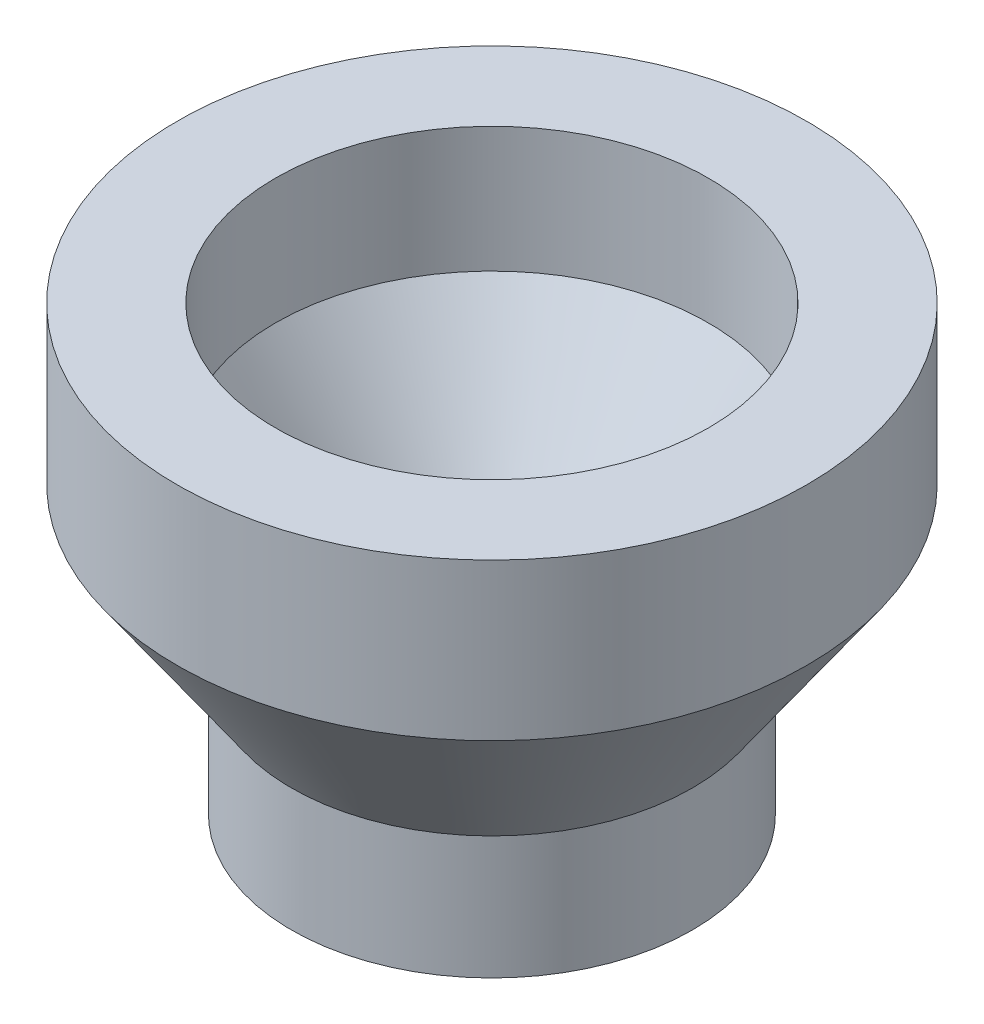
ISO-10303-21;
HEADER;
FILE_DESCRIPTION(('STEP AP214'),'2;1');
FILE_NAME('part.step','',(''),(''),'','','');
FILE_SCHEMA(('AUTOMOTIVE_DESIGN { 1 0 10303 214 1 1 1 1 }'));
ENDSEC;
DATA;
#1=APPLICATION_CONTEXT('core data for automotive mechanical design processes');
#2=APPLICATION_PROTOCOL_DEFINITION('international standard','automotive_design',2000,#1);
#3=PRODUCT_CONTEXT('',#1,'mechanical');
#4=PRODUCT('Part','Part','',(#3));
#5=PRODUCT_RELATED_PRODUCT_CATEGORY('part','',(#4));
#6=PRODUCT_DEFINITION_FORMATION('','',#4);
#7=PRODUCT_DEFINITION_CONTEXT('part definition',#1,'design');
#8=PRODUCT_DEFINITION('design','',#6,#7);
#9=PRODUCT_DEFINITION_SHAPE('','',#8);
#10=(LENGTH_UNIT() NAMED_UNIT(*) SI_UNIT(.MILLI.,.METRE.));
#11=(NAMED_UNIT(*) PLANE_ANGLE_UNIT() SI_UNIT($,.RADIAN.));
#12=(NAMED_UNIT(*) SI_UNIT($,.STERADIAN.) SOLID_ANGLE_UNIT());
#13=UNCERTAINTY_MEASURE_WITH_UNIT(LENGTH_MEASURE(1.E-05),#10,'distance_accuracy_value','');
#14=(GEOMETRIC_REPRESENTATION_CONTEXT(3) GLOBAL_UNCERTAINTY_ASSIGNED_CONTEXT((#13)) GLOBAL_UNIT_ASSIGNED_CONTEXT((#10,
#11,#12)) REPRESENTATION_CONTEXT('',''));
#15=CARTESIAN_POINT('',(0.,0.,0.));
#16=DIRECTION('',(0.,0.,1.));
#17=DIRECTION('',(1.,0.,0.));
#18=AXIS2_PLACEMENT_3D('',#15,#16,#17);
#19=CARTESIAN_POINT('',(0.,9.79011851256967,0.));
#20=DIRECTION('',(0.,-1.,0.));
#21=DIRECTION('',(1.,0.,0.));
#22=AXIS2_PLACEMENT_3D('',#19,#20,#21);
#23=CYLINDRICAL_SURFACE('',#22,2.575);
#24=CARTESIAN_POINT('',(0.,38.6347900936987,0.));
#25=DIRECTION('',(0.,-1.,0.));
#26=DIRECTION('',(1.,0.,0.));
#27=AXIS2_PLACEMENT_3D('',#24,#25,#26);
#28=CIRCLE('',#27,2.575);
#29=CARTESIAN_POINT('',(2.575,38.6347900936987,0.));
#30=VERTEX_POINT('',#29);
#31=EDGE_CURVE('E59',#30,#30,#28,.T.);
#32=ORIENTED_EDGE('',*,*,#31,.F.);
#33=EDGE_LOOP('',(#32));
#34=FACE_BOUND('',#33,.T.);
#35=CARTESIAN_POINT('',(0.,34.7901185125697,0.));
#36=DIRECTION('',(0.,-1.,0.));
#37=DIRECTION('',(1.,0.,0.));
#38=AXIS2_PLACEMENT_3D('',#35,#36,#37);
#39=CIRCLE('',#38,2.575);
#40=CARTESIAN_POINT('',(2.575,34.7901185125697,0.));
#41=VERTEX_POINT('',#40);
#42=EDGE_CURVE('E10',#41,#41,#39,.T.);
#43=ORIENTED_EDGE('',*,*,#42,.T.);
#44=EDGE_LOOP('',(#43));
#45=FACE_BOUND('',#44,.T.);
#46=ADVANCED_FACE('F31',(#34,#45),#23,.F.);
#47=CARTESIAN_POINT('',(-2.575,34.7901185125697,0.));
#48=DIRECTION('',(0.,1.,0.));
#49=DIRECTION('',(-1.,0.,0.));
#50=AXIS2_PLACEMENT_3D('',#47,#48,#49);
#51=PLANE('',#50);
#52=ORIENTED_EDGE('',*,*,#42,.F.);
#53=EDGE_LOOP('',(#52));
#54=FACE_BOUND('',#53,.T.);
#55=CARTESIAN_POINT('',(0.,34.7901185125697,0.));
#56=DIRECTION('',(0.,-1.,0.));
#57=DIRECTION('',(1.,0.,0.));
#58=AXIS2_PLACEMENT_3D('',#55,#56,#57);
#59=CIRCLE('',#58,4.075);
#60=CARTESIAN_POINT('',(4.075,34.7901185125697,0.));
#61=VERTEX_POINT('',#60);
#62=EDGE_CURVE('E37',#61,#61,#59,.T.);
#63=ORIENTED_EDGE('',*,*,#62,.T.);
#64=EDGE_LOOP('',(#63));
#65=FACE_BOUND('',#64,.T.);
#66=ADVANCED_FACE('F66',(#54,#65),#51,.F.);
#67=CARTESIAN_POINT('',(0.,9.79011851256967,0.));
#68=DIRECTION('',(0.,-1.,0.));
#69=DIRECTION('',(1.,0.,0.));
#70=AXIS2_PLACEMENT_3D('',#67,#68,#69);
#71=CYLINDRICAL_SURFACE('',#70,4.075);
#72=ORIENTED_EDGE('',*,*,#62,.F.);
#73=EDGE_LOOP('',(#72));
#74=FACE_BOUND('',#73,.T.);
#75=CARTESIAN_POINT('',(0.,37.2901185125697,0.));
#76=DIRECTION('',(0.,-1.,0.));
#77=DIRECTION('',(1.,0.,0.));
#78=AXIS2_PLACEMENT_3D('',#75,#76,#77);
#79=CIRCLE('',#78,4.075);
#80=CARTESIAN_POINT('',(4.075,37.2901185125697,0.));
#81=VERTEX_POINT('',#80);
#82=EDGE_CURVE('E41',#81,#81,#79,.T.);
#83=ORIENTED_EDGE('',*,*,#82,.T.);
#84=EDGE_LOOP('',(#83));
#85=FACE_BOUND('',#84,.T.);
#86=ADVANCED_FACE('F70',(#74,#85),#71,.T.);
#87=CARTESIAN_POINT('',(0.,40.6105626282451,0.));
#88=DIRECTION('',(0.,1.,0.));
#89=DIRECTION('',(-1.,0.,0.));
#90=AXIS2_PLACEMENT_3D('',#87,#88,#89);
#91=CONICAL_SURFACE('',#90,6.4,0.610865238198017);
#92=ORIENTED_EDGE('',*,*,#82,.F.);
#93=EDGE_LOOP('',(#92));
#94=FACE_BOUND('',#93,.T.);
#95=CARTESIAN_POINT('',(0.,40.6105626282451,0.));
#96=DIRECTION('',(0.,-1.,0.));
#97=DIRECTION('',(1.,0.,0.));
#98=AXIS2_PLACEMENT_3D('',#95,#96,#97);
#99=CIRCLE('',#98,6.4);
#100=CARTESIAN_POINT('',(6.4,40.6105626282451,0.));
#101=VERTEX_POINT('',#100);
#102=EDGE_CURVE('E45',#101,#101,#99,.T.);
#103=ORIENTED_EDGE('',*,*,#102,.T.);
#104=EDGE_LOOP('',(#103));
#105=FACE_BOUND('',#104,.T.);
#106=ADVANCED_FACE('F75',(#94,#105),#91,.T.);
#107=CARTESIAN_POINT('',(0.,9.79011851256967,0.));
#108=DIRECTION('',(0.,-1.,0.));
#109=DIRECTION('',(1.,0.,0.));
#110=AXIS2_PLACEMENT_3D('',#107,#108,#109);
#111=CYLINDRICAL_SURFACE('',#110,6.4);
#112=ORIENTED_EDGE('',*,*,#102,.F.);
#113=EDGE_LOOP('',(#112));
#114=FACE_BOUND('',#113,.T.);
#115=CARTESIAN_POINT('',(0.,43.7901185125697,0.));
#116=DIRECTION('',(0.,-1.,0.));
#117=DIRECTION('',(1.,0.,0.));
#118=AXIS2_PLACEMENT_3D('',#115,#116,#117);
#119=CIRCLE('',#118,6.4);
#120=CARTESIAN_POINT('',(6.4,43.7901185125697,0.));
#121=VERTEX_POINT('',#120);
#122=EDGE_CURVE('E50',#121,#121,#119,.T.);
#123=ORIENTED_EDGE('',*,*,#122,.T.);
#124=EDGE_LOOP('',(#123));
#125=FACE_BOUND('',#124,.T.);
#126=ADVANCED_FACE('F81',(#114,#125),#111,.T.);
#127=CARTESIAN_POINT('',(-6.4,43.7901185125697,0.));
#128=DIRECTION('',(0.,-1.,0.));
#129=DIRECTION('',(1.,0.,0.));
#130=AXIS2_PLACEMENT_3D('',#127,#128,#129);
#131=PLANE('',#130);
#132=ORIENTED_EDGE('',*,*,#122,.F.);
#133=EDGE_LOOP('',(#132));
#134=FACE_BOUND('',#133,.T.);
#135=CARTESIAN_POINT('',(0.,43.7901185125697,0.));
#136=DIRECTION('',(0.,-1.,0.));
#137=DIRECTION('',(1.,0.,0.));
#138=AXIS2_PLACEMENT_3D('',#135,#136,#137);
#139=CIRCLE('',#138,4.4);
#140=CARTESIAN_POINT('',(4.4,43.7901185125697,0.));
#141=VERTEX_POINT('',#140);
#142=EDGE_CURVE('E53',#141,#141,#139,.T.);
#143=ORIENTED_EDGE('',*,*,#142,.T.);
#144=EDGE_LOOP('',(#143));
#145=FACE_BOUND('',#144,.T.);
#146=ADVANCED_FACE('F85',(#134,#145),#131,.F.);
#147=CARTESIAN_POINT('',(0.,9.79011851256967,0.));
#148=DIRECTION('',(0.,-1.,0.));
#149=DIRECTION('',(1.,0.,0.));
#150=AXIS2_PLACEMENT_3D('',#147,#148,#149);
#151=CYLINDRICAL_SURFACE('',#150,4.4);
#152=ORIENTED_EDGE('',*,*,#142,.F.);
#153=EDGE_LOOP('',(#152));
#154=FACE_BOUND('',#153,.T.);
#155=CARTESIAN_POINT('',(0.,41.241160206003,0.));
#156=DIRECTION('',(0.,-1.,0.));
#157=DIRECTION('',(1.,0.,0.));
#158=AXIS2_PLACEMENT_3D('',#155,#156,#157);
#159=CIRCLE('',#158,4.4);
#160=CARTESIAN_POINT('',(4.4,41.241160206003,0.));
#161=VERTEX_POINT('',#160);
#162=EDGE_CURVE('E56',#161,#161,#159,.T.);
#163=ORIENTED_EDGE('',*,*,#162,.T.);
#164=EDGE_LOOP('',(#163));
#165=FACE_BOUND('',#164,.T.);
#166=ADVANCED_FACE('F89',(#154,#165),#151,.F.);
#167=CARTESIAN_POINT('',(0.,38.6347900936987,0.));
#168=DIRECTION('',(0.,1.,0.));
#169=DIRECTION('',(-1.,0.,0.));
#170=AXIS2_PLACEMENT_3D('',#167,#168,#169);
#171=CONICAL_SURFACE('',#170,2.575,0.610865238198018);
#172=ORIENTED_EDGE('',*,*,#162,.F.);
#173=EDGE_LOOP('',(#172));
#174=FACE_BOUND('',#173,.T.);
#175=ORIENTED_EDGE('',*,*,#31,.T.);
#176=EDGE_LOOP('',(#175));
#177=FACE_BOUND('',#176,.T.);
#178=ADVANCED_FACE('F63',(#174,#177),#171,.F.);
#179=CLOSED_SHELL('',(#46,#66,#86,#106,#126,#146,#166,#178));
#180=MANIFOLD_SOLID_BREP('B2',#179);
#181=ADVANCED_BREP_SHAPE_REPRESENTATION('',(#18,#180),#14);
#182=SHAPE_DEFINITION_REPRESENTATION(#9,#181);
ENDSEC;
END-ISO-10303-21;
